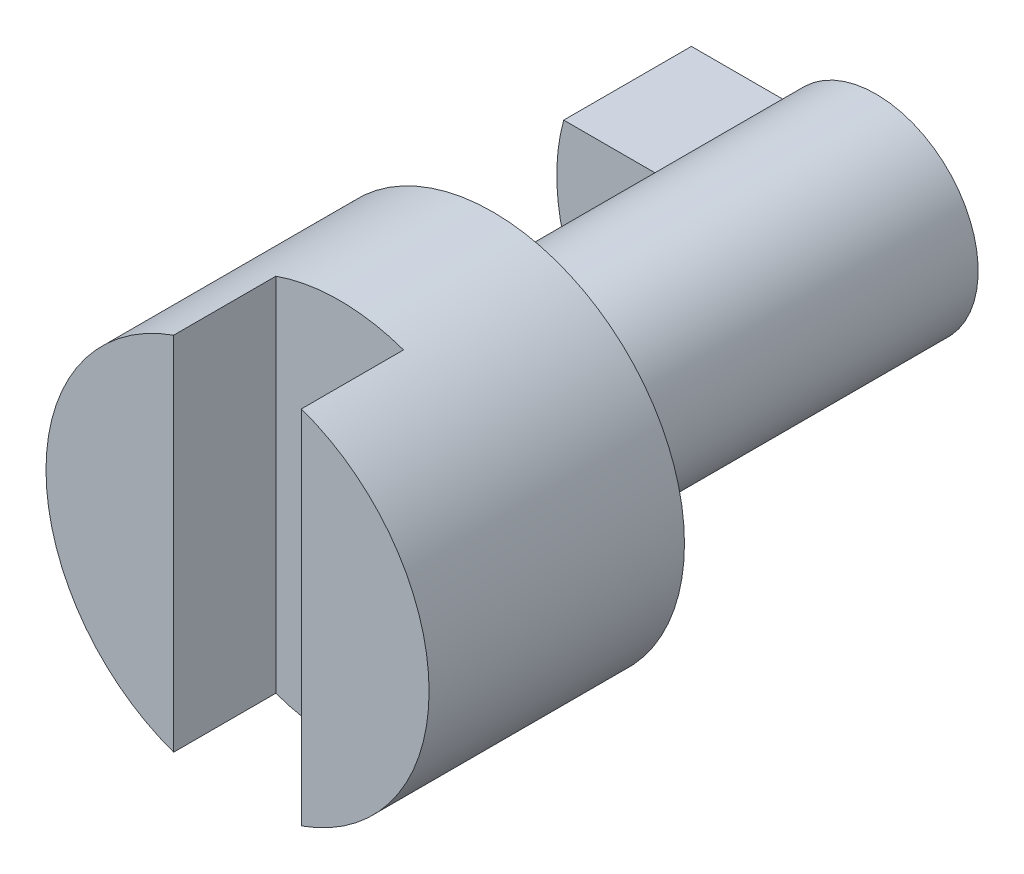
ISO-10303-21;
HEADER;
FILE_DESCRIPTION(('STEP AP214'),'2;1');
FILE_NAME('part.step','',(''),(''),'','','');
FILE_SCHEMA(('AUTOMOTIVE_DESIGN { 1 0 10303 214 1 1 1 1 }'));
ENDSEC;
DATA;
#1=APPLICATION_CONTEXT('core data for automotive mechanical design processes');
#2=APPLICATION_PROTOCOL_DEFINITION('international standard','automotive_design',2000,#1);
#3=PRODUCT_CONTEXT('',#1,'mechanical');
#4=PRODUCT('Part','Part','',(#3));
#5=PRODUCT_RELATED_PRODUCT_CATEGORY('part','',(#4));
#6=PRODUCT_DEFINITION_FORMATION('','',#4);
#7=PRODUCT_DEFINITION_CONTEXT('part definition',#1,'design');
#8=PRODUCT_DEFINITION('design','',#6,#7);
#9=PRODUCT_DEFINITION_SHAPE('','',#8);
#10=(LENGTH_UNIT() NAMED_UNIT(*) SI_UNIT(.MILLI.,.METRE.));
#11=(NAMED_UNIT(*) PLANE_ANGLE_UNIT() SI_UNIT($,.RADIAN.));
#12=(NAMED_UNIT(*) SI_UNIT($,.STERADIAN.) SOLID_ANGLE_UNIT());
#13=UNCERTAINTY_MEASURE_WITH_UNIT(LENGTH_MEASURE(1.E-05),#10,'distance_accuracy_value','');
#14=(GEOMETRIC_REPRESENTATION_CONTEXT(3) GLOBAL_UNCERTAINTY_ASSIGNED_CONTEXT((#13)) GLOBAL_UNIT_ASSIGNED_CONTEXT((#10,
#11,#12)) REPRESENTATION_CONTEXT('',''));
#15=CARTESIAN_POINT('',(0.,0.,0.));
#16=DIRECTION('',(0.,0.,1.));
#17=DIRECTION('',(1.,0.,0.));
#18=AXIS2_PLACEMENT_3D('',#15,#16,#17);
#19=CARTESIAN_POINT('',(0.,-2.,-10.));
#20=DIRECTION('',(0.,-1.,0.));
#21=DIRECTION('',(1.,0.,0.));
#22=AXIS2_PLACEMENT_3D('',#19,#20,#21);
#23=PLANE('',#22);
#24=DIRECTION('',(-1.,0.,0.));
#25=VECTOR('',#24,1.);
#26=CARTESIAN_POINT('',(0.,-2.,-15.));
#27=LINE('',#26,#25);
#28=CARTESIAN_POINT('',(-3.46410161513775,-2.,-15.));
#29=VERTEX_POINT('',#28);
#30=CARTESIAN_POINT('',(-7.22841614740048,-2.,-15.));
#31=VERTEX_POINT('',#30);
#32=EDGE_CURVE('E111',#29,#31,#27,.T.);
#33=ORIENTED_EDGE('',*,*,#32,.F.);
#34=DIRECTION('',(0.,0.,-1.));
#35=VECTOR('',#34,1.);
#36=CARTESIAN_POINT('',(-3.46410161513775,-2.,-10.));
#37=LINE('',#36,#35);
#38=CARTESIAN_POINT('',(-3.46410161513775,-2.,-10.));
#39=VERTEX_POINT('',#38);
#40=EDGE_CURVE('E12',#39,#29,#37,.T.);
#41=ORIENTED_EDGE('',*,*,#40,.F.);
#42=DIRECTION('',(-1.,0.,0.));
#43=VECTOR('',#42,1.);
#44=CARTESIAN_POINT('',(0.,-2.,-10.));
#45=LINE('',#44,#43);
#46=CARTESIAN_POINT('',(-7.22841614740048,-2.,-10.));
#47=VERTEX_POINT('',#46);
#48=EDGE_CURVE('E106',#39,#47,#45,.T.);
#49=ORIENTED_EDGE('',*,*,#48,.T.);
#50=DIRECTION('',(0.,0.,-1.));
#51=VECTOR('',#50,1.);
#52=CARTESIAN_POINT('',(-7.22841614740048,-2.,-10.));
#53=LINE('',#52,#51);
#54=EDGE_CURVE('E49',#47,#31,#53,.T.);
#55=ORIENTED_EDGE('',*,*,#54,.T.);
#56=EDGE_LOOP('',(#33,#41,#49,#55));
#57=FACE_BOUND('',#56,.T.);
#58=ADVANCED_FACE('F46',(#57),#23,.T.);
#59=CARTESIAN_POINT('',(0.,0.,-10.));
#60=DIRECTION('',(0.,0.,-1.));
#61=DIRECTION('',(-1.,0.,0.));
#62=AXIS2_PLACEMENT_3D('',#59,#60,#61);
#63=CYLINDRICAL_SURFACE('',#62,4.);
#64=CARTESIAN_POINT('',(0.,0.,-15.));
#65=DIRECTION('',(0.,0.,-1.));
#66=DIRECTION('',(-1.,0.,0.));
#67=AXIS2_PLACEMENT_3D('',#64,#65,#66);
#68=CIRCLE('',#67,4.);
#69=CARTESIAN_POINT('',(-3.46410161513775,2.,-15.));
#70=VERTEX_POINT('',#69);
#71=EDGE_CURVE('E79',#29,#70,#68,.T.);
#72=ORIENTED_EDGE('',*,*,#71,.T.);
#73=DIRECTION('',(0.,0.,-1.));
#74=VECTOR('',#73,1.);
#75=CARTESIAN_POINT('',(-3.46410161513775,2.,-10.));
#76=LINE('',#75,#74);
#77=CARTESIAN_POINT('',(-3.46410161513775,2.,-10.));
#78=VERTEX_POINT('',#77);
#79=EDGE_CURVE('E55',#78,#70,#76,.T.);
#80=ORIENTED_EDGE('',*,*,#79,.F.);
#81=CARTESIAN_POINT('',(0.,0.,-10.));
#82=DIRECTION('',(0.,0.,-1.));
#83=DIRECTION('',(-1.,0.,0.));
#84=AXIS2_PLACEMENT_3D('',#81,#82,#83);
#85=CIRCLE('',#84,4.);
#86=EDGE_CURVE('E96',#39,#78,#85,.T.);
#87=ORIENTED_EDGE('',*,*,#86,.F.);
#88=ORIENTED_EDGE('',*,*,#40,.T.);
#89=EDGE_LOOP('',(#72,#80,#87,#88));
#90=FACE_BOUND('',#89,.T.);
#91=ADVANCED_FACE('F121',(#90),#63,.F.);
#92=CARTESIAN_POINT('',(0.,2.,-10.));
#93=DIRECTION('',(0.,-1.,0.));
#94=DIRECTION('',(0.,0.,-1.));
#95=AXIS2_PLACEMENT_3D('',#92,#93,#94);
#96=PLANE('',#95);
#97=DIRECTION('',(-1.,0.,0.));
#98=VECTOR('',#97,1.);
#99=CARTESIAN_POINT('',(0.,2.,-15.));
#100=LINE('',#99,#98);
#101=CARTESIAN_POINT('',(-7.22841614740048,2.,-15.));
#102=VERTEX_POINT('',#101);
#103=EDGE_CURVE('E103',#70,#102,#100,.T.);
#104=ORIENTED_EDGE('',*,*,#103,.T.);
#105=DIRECTION('',(0.,0.,-1.));
#106=VECTOR('',#105,1.);
#107=CARTESIAN_POINT('',(-7.22841614740048,2.,-10.));
#108=LINE('',#107,#106);
#109=CARTESIAN_POINT('',(-7.22841614740048,2.,-10.));
#110=VERTEX_POINT('',#109);
#111=EDGE_CURVE('E100',#110,#102,#108,.T.);
#112=ORIENTED_EDGE('',*,*,#111,.F.);
#113=DIRECTION('',(-1.,0.,0.));
#114=VECTOR('',#113,1.);
#115=CARTESIAN_POINT('',(0.,2.,-10.));
#116=LINE('',#115,#114);
#117=EDGE_CURVE('E91',#78,#110,#116,.T.);
#118=ORIENTED_EDGE('',*,*,#117,.F.);
#119=ORIENTED_EDGE('',*,*,#79,.T.);
#120=EDGE_LOOP('',(#104,#112,#118,#119));
#121=FACE_BOUND('',#120,.T.);
#122=ADVANCED_FACE('F101',(#121),#96,.F.);
#123=CARTESIAN_POINT('',(0.,0.,-10.));
#124=DIRECTION('',(0.,0.,-1.));
#125=DIRECTION('',(-1.,0.,0.));
#126=AXIS2_PLACEMENT_3D('',#123,#124,#125);
#127=CYLINDRICAL_SURFACE('',#126,7.5);
#128=CARTESIAN_POINT('',(0.,0.,-15.));
#129=DIRECTION('',(0.,0.,-1.));
#130=DIRECTION('',(-1.,0.,0.));
#131=AXIS2_PLACEMENT_3D('',#128,#129,#130);
#132=CIRCLE('',#131,7.5);
#133=EDGE_CURVE('E114',#31,#102,#132,.T.);
#134=ORIENTED_EDGE('',*,*,#133,.F.);
#135=ORIENTED_EDGE('',*,*,#54,.F.);
#136=CARTESIAN_POINT('',(0.,0.,-10.));
#137=DIRECTION('',(0.,0.,-1.));
#138=DIRECTION('',(-1.,0.,0.));
#139=AXIS2_PLACEMENT_3D('',#136,#137,#138);
#140=CIRCLE('',#139,7.5);
#141=EDGE_CURVE('E95',#47,#110,#140,.T.);
#142=ORIENTED_EDGE('',*,*,#141,.T.);
#143=ORIENTED_EDGE('',*,*,#111,.T.);
#144=EDGE_LOOP('',(#134,#135,#142,#143));
#145=FACE_BOUND('',#144,.T.);
#146=ADVANCED_FACE('F105',(#145),#127,.T.);
#147=CARTESIAN_POINT('',(0.,0.,-10.));
#148=DIRECTION('',(0.,0.,-1.));
#149=DIRECTION('',(-1.,0.,0.));
#150=AXIS2_PLACEMENT_3D('',#147,#148,#149);
#151=PLANE('',#150);
#152=ORIENTED_EDGE('',*,*,#48,.F.);
#153=ORIENTED_EDGE('',*,*,#86,.T.);
#154=ORIENTED_EDGE('',*,*,#117,.T.);
#155=ORIENTED_EDGE('',*,*,#141,.F.);
#156=EDGE_LOOP('',(#152,#153,#154,#155));
#157=FACE_BOUND('',#156,.T.);
#158=ADVANCED_FACE('F94',(#157),#151,.F.);
#159=CARTESIAN_POINT('',(0.,0.,-15.));
#160=DIRECTION('',(0.,0.,-1.));
#161=DIRECTION('',(-1.,0.,0.));
#162=AXIS2_PLACEMENT_3D('',#159,#160,#161);
#163=PLANE('',#162);
#164=ORIENTED_EDGE('',*,*,#32,.T.);
#165=ORIENTED_EDGE('',*,*,#133,.T.);
#166=ORIENTED_EDGE('',*,*,#103,.F.);
#167=ORIENTED_EDGE('',*,*,#71,.F.);
#168=EDGE_LOOP('',(#164,#165,#166,#167));
#169=FACE_BOUND('',#168,.T.);
#170=ADVANCED_FACE('F119',(#169),#163,.T.);
#171=CLOSED_SHELL('',(#58,#91,#122,#146,#158,#170));
#172=MANIFOLD_SOLID_BREP('B2',#171);
#173=CARTESIAN_POINT('',(0.,0.,10.));
#174=DIRECTION('',(0.,0.,1.));
#175=DIRECTION('',(1.,0.,0.));
#176=AXIS2_PLACEMENT_3D('',#173,#174,#175);
#177=PLANE('',#176);
#178=DIRECTION('',(0.,1.,0.));
#179=VECTOR('',#178,1.);
#180=CARTESIAN_POINT('',(2.5,0.,10.));
#181=LINE('',#180,#179);
#182=CARTESIAN_POINT('',(2.5,-7.07106781186548,10.));
#183=VERTEX_POINT('',#182);
#184=CARTESIAN_POINT('',(2.5,7.07106781186547,10.));
#185=VERTEX_POINT('',#184);
#186=EDGE_CURVE('E219',#183,#185,#181,.T.);
#187=ORIENTED_EDGE('',*,*,#186,.F.);
#188=CARTESIAN_POINT('',(0.,0.,10.));
#189=DIRECTION('',(0.,0.,1.));
#190=DIRECTION('',(1.,0.,0.));
#191=AXIS2_PLACEMENT_3D('',#188,#189,#190);
#192=CIRCLE('',#191,7.5);
#193=EDGE_CURVE('E231',#183,#185,#192,.T.);
#194=ORIENTED_EDGE('',*,*,#193,.T.);
#195=EDGE_LOOP('',(#187,#194));
#196=FACE_BOUND('',#195,.T.);
#197=ADVANCED_FACE('F172',(#196),#177,.T.);
#198=CARTESIAN_POINT('',(0.,0.,10.));
#199=DIRECTION('',(0.,0.,-1.));
#200=DIRECTION('',(-1.,0.,0.));
#201=AXIS2_PLACEMENT_3D('',#198,#199,#200);
#202=CYLINDRICAL_SURFACE('',#201,7.5);
#203=CARTESIAN_POINT('',(0.,0.,6.));
#204=DIRECTION('',(0.,0.,1.));
#205=DIRECTION('',(1.,0.,0.));
#206=AXIS2_PLACEMENT_3D('',#203,#204,#205);
#207=CIRCLE('',#206,7.5);
#208=CARTESIAN_POINT('',(2.5,7.07106781186548,6.));
#209=VERTEX_POINT('',#208);
#210=CARTESIAN_POINT('',(-2.5,7.07106781186548,6.));
#211=VERTEX_POINT('',#210);
#212=EDGE_CURVE('E44',#209,#211,#207,.T.);
#213=ORIENTED_EDGE('',*,*,#212,.F.);
#214=DIRECTION('',(0.,0.,-1.));
#215=VECTOR('',#214,1.);
#216=CARTESIAN_POINT('',(2.5,7.07106781186548,10.));
#217=LINE('',#216,#215);
#218=EDGE_CURVE('E195',#209,#185,#217,.F.);
#219=ORIENTED_EDGE('',*,*,#218,.T.);
#220=ORIENTED_EDGE('',*,*,#193,.F.);
#221=DIRECTION('',(0.,0.,-1.));
#222=VECTOR('',#221,1.);
#223=CARTESIAN_POINT('',(2.5,-7.07106781186548,10.));
#224=LINE('',#223,#222);
#225=CARTESIAN_POINT('',(2.5,-7.07106781186548,6.));
#226=VERTEX_POINT('',#225);
#227=EDGE_CURVE('E246',#183,#226,#224,.T.);
#228=ORIENTED_EDGE('',*,*,#227,.T.);
#229=CARTESIAN_POINT('',(-2.5,-7.07106781186548,6.));
#230=VERTEX_POINT('',#229);
#231=EDGE_CURVE('E176',#230,#226,#207,.T.);
#232=ORIENTED_EDGE('',*,*,#231,.F.);
#233=DIRECTION('',(0.,0.,-1.));
#234=VECTOR('',#233,1.);
#235=CARTESIAN_POINT('',(-2.5,-7.07106781186548,10.));
#236=LINE('',#235,#234);
#237=CARTESIAN_POINT('',(-2.5,-7.07106781186548,10.));
#238=VERTEX_POINT('',#237);
#239=EDGE_CURVE('E214',#230,#238,#236,.F.);
#240=ORIENTED_EDGE('',*,*,#239,.T.);
#241=CARTESIAN_POINT('',(-2.5,7.07106781186548,10.));
#242=VERTEX_POINT('',#241);
#243=EDGE_CURVE('E226',#242,#238,#192,.T.);
#244=ORIENTED_EDGE('',*,*,#243,.F.);
#245=DIRECTION('',(0.,0.,-1.));
#246=VECTOR('',#245,1.);
#247=CARTESIAN_POINT('',(-2.5,7.07106781186548,10.));
#248=LINE('',#247,#246);
#249=EDGE_CURVE('E187',#242,#211,#248,.T.);
#250=ORIENTED_EDGE('',*,*,#249,.T.);
#251=EDGE_LOOP('',(#213,#219,#220,#228,#232,#240,#244,#250));
#252=FACE_BOUND('',#251,.T.);
#253=CARTESIAN_POINT('',(0.,0.,0.));
#254=DIRECTION('',(0.,0.,1.));
#255=DIRECTION('',(1.,0.,0.));
#256=AXIS2_PLACEMENT_3D('',#253,#254,#255);
#257=CIRCLE('',#256,7.5);
#258=CARTESIAN_POINT('',(7.5,0.,0.));
#259=VERTEX_POINT('',#258);
#260=EDGE_CURVE('E236',#259,#259,#257,.T.);
#261=ORIENTED_EDGE('',*,*,#260,.T.);
#262=EDGE_LOOP('',(#261));
#263=FACE_BOUND('',#262,.T.);
#264=ADVANCED_FACE('F174',(#252,#263),#202,.T.);
#265=DIRECTION('',(0.,-1.,0.));
#266=VECTOR('',#265,1.);
#267=CARTESIAN_POINT('',(-2.5,0.,10.));
#268=LINE('',#267,#266);
#269=EDGE_CURVE('E211',#242,#238,#268,.T.);
#270=ORIENTED_EDGE('',*,*,#269,.F.);
#271=ORIENTED_EDGE('',*,*,#243,.T.);
#272=EDGE_LOOP('',(#270,#271));
#273=FACE_BOUND('',#272,.T.);
#274=ADVANCED_FACE('F230',(#273),#177,.T.);
#275=CARTESIAN_POINT('',(0.,0.,0.));
#276=DIRECTION('',(0.,0.,1.));
#277=DIRECTION('',(1.,0.,0.));
#278=AXIS2_PLACEMENT_3D('',#275,#276,#277);
#279=PLANE('',#278);
#280=CARTESIAN_POINT('',(0.,0.,0.));
#281=DIRECTION('',(0.,0.,-1.));
#282=DIRECTION('',(-1.,0.,0.));
#283=AXIS2_PLACEMENT_3D('',#280,#281,#282);
#284=CIRCLE('',#283,4.);
#285=CARTESIAN_POINT('',(-4.,0.,0.));
#286=VERTEX_POINT('',#285);
#287=EDGE_CURVE('E220',#286,#286,#284,.T.);
#288=ORIENTED_EDGE('',*,*,#287,.F.);
#289=EDGE_LOOP('',(#288));
#290=FACE_BOUND('',#289,.T.);
#291=ORIENTED_EDGE('',*,*,#260,.F.);
#292=EDGE_LOOP('',(#291));
#293=FACE_BOUND('',#292,.T.);
#294=ADVANCED_FACE('F262',(#290,#293),#279,.F.);
#295=CARTESIAN_POINT('',(0.,0.,-15.));
#296=DIRECTION('',(0.,0.,1.));
#297=DIRECTION('',(1.,0.,0.));
#298=AXIS2_PLACEMENT_3D('',#295,#296,#297);
#299=CYLINDRICAL_SURFACE('',#298,4.);
#300=CARTESIAN_POINT('',(0.,0.,-15.));
#301=DIRECTION('',(0.,0.,-1.));
#302=DIRECTION('',(-1.,0.,0.));
#303=AXIS2_PLACEMENT_3D('',#300,#301,#302);
#304=CIRCLE('',#303,4.);
#305=CARTESIAN_POINT('',(-4.,0.,-15.));
#306=VERTEX_POINT('',#305);
#307=EDGE_CURVE('E240',#306,#306,#304,.T.);
#308=ORIENTED_EDGE('',*,*,#307,.F.);
#309=EDGE_LOOP('',(#308));
#310=FACE_BOUND('',#309,.T.);
#311=ORIENTED_EDGE('',*,*,#287,.T.);
#312=EDGE_LOOP('',(#311));
#313=FACE_BOUND('',#312,.T.);
#314=ADVANCED_FACE('F266',(#310,#313),#299,.T.);
#315=CARTESIAN_POINT('',(0.,0.,-15.));
#316=DIRECTION('',(0.,0.,-1.));
#317=DIRECTION('',(-1.,0.,0.));
#318=AXIS2_PLACEMENT_3D('',#315,#316,#317);
#319=PLANE('',#318);
#320=ORIENTED_EDGE('',*,*,#307,.T.);
#321=EDGE_LOOP('',(#320));
#322=FACE_BOUND('',#321,.T.);
#323=ADVANCED_FACE('F271',(#322),#319,.T.);
#324=CARTESIAN_POINT('',(0.,0.,6.));
#325=DIRECTION('',(0.,0.,1.));
#326=DIRECTION('',(1.,0.,0.));
#327=AXIS2_PLACEMENT_3D('',#324,#325,#326);
#328=PLANE('',#327);
#329=ORIENTED_EDGE('',*,*,#212,.T.);
#330=DIRECTION('',(0.,-1.,0.));
#331=VECTOR('',#330,1.);
#332=CARTESIAN_POINT('',(-2.5,35.4528310392094,6.));
#333=LINE('',#332,#331);
#334=EDGE_CURVE('E228',#211,#230,#333,.T.);
#335=ORIENTED_EDGE('',*,*,#334,.T.);
#336=ORIENTED_EDGE('',*,*,#231,.T.);
#337=DIRECTION('',(0.,1.,0.));
#338=VECTOR('',#337,1.);
#339=CARTESIAN_POINT('',(2.5,35.4528310392094,6.));
#340=LINE('',#339,#338);
#341=EDGE_CURVE('E244',#226,#209,#340,.T.);
#342=ORIENTED_EDGE('',*,*,#341,.T.);
#343=EDGE_LOOP('',(#329,#335,#336,#342));
#344=FACE_BOUND('',#343,.T.);
#345=ADVANCED_FACE('F243',(#344),#328,.T.);
#346=CARTESIAN_POINT('',(2.5,35.4528310392094,6.));
#347=DIRECTION('',(1.,0.,0.));
#348=DIRECTION('',(0.,1.,0.));
#349=AXIS2_PLACEMENT_3D('',#346,#347,#348);
#350=PLANE('',#349);
#351=ORIENTED_EDGE('',*,*,#186,.T.);
#352=ORIENTED_EDGE('',*,*,#218,.F.);
#353=ORIENTED_EDGE('',*,*,#341,.F.);
#354=ORIENTED_EDGE('',*,*,#227,.F.);
#355=EDGE_LOOP('',(#351,#352,#353,#354));
#356=FACE_BOUND('',#355,.T.);
#357=ADVANCED_FACE('F245',(#356),#350,.F.);
#358=CARTESIAN_POINT('',(-2.5,35.4528310392094,6.));
#359=DIRECTION('',(-1.,0.,0.));
#360=DIRECTION('',(0.,-1.,0.));
#361=AXIS2_PLACEMENT_3D('',#358,#359,#360);
#362=PLANE('',#361);
#363=ORIENTED_EDGE('',*,*,#269,.T.);
#364=ORIENTED_EDGE('',*,*,#239,.F.);
#365=ORIENTED_EDGE('',*,*,#334,.F.);
#366=ORIENTED_EDGE('',*,*,#249,.F.);
#367=EDGE_LOOP('',(#363,#364,#365,#366));
#368=FACE_BOUND('',#367,.T.);
#369=ADVANCED_FACE('F213',(#368),#362,.F.);
#370=CLOSED_SHELL('',(#197,#264,#274,#294,#314,#323,#345,#357,#369));
#371=MANIFOLD_SOLID_BREP('B6',#370);
#372=ADVANCED_BREP_SHAPE_REPRESENTATION('',(#18,#172,#371),#14);
#373=SHAPE_DEFINITION_REPRESENTATION(#9,#372);
ENDSEC;
END-ISO-10303-21;
